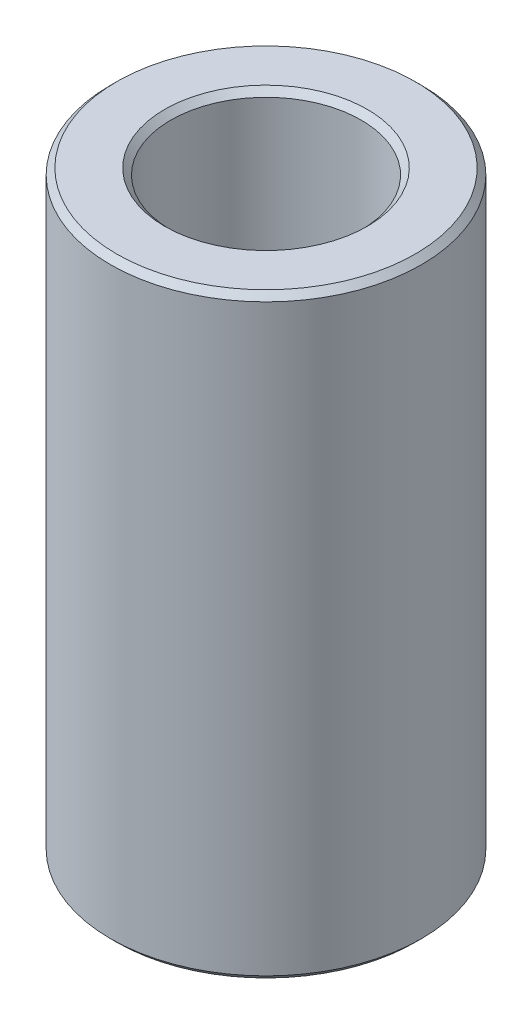
ISO-10303-21;
HEADER;
FILE_DESCRIPTION(('STEP AP214'),'2;1');
FILE_NAME('part.step','',(''),(''),'','','');
FILE_SCHEMA(('AUTOMOTIVE_DESIGN { 1 0 10303 214 1 1 1 1 }'));
ENDSEC;
DATA;
#1=APPLICATION_CONTEXT('core data for automotive mechanical design processes');
#2=APPLICATION_PROTOCOL_DEFINITION('international standard','automotive_design',2000,#1);
#3=PRODUCT_CONTEXT('',#1,'mechanical');
#4=PRODUCT('Part','Part','',(#3));
#5=PRODUCT_RELATED_PRODUCT_CATEGORY('part','',(#4));
#6=PRODUCT_DEFINITION_FORMATION('','',#4);
#7=PRODUCT_DEFINITION_CONTEXT('part definition',#1,'design');
#8=PRODUCT_DEFINITION('design','',#6,#7);
#9=PRODUCT_DEFINITION_SHAPE('','',#8);
#10=(LENGTH_UNIT() NAMED_UNIT(*) SI_UNIT(.MILLI.,.METRE.));
#11=(NAMED_UNIT(*) PLANE_ANGLE_UNIT() SI_UNIT($,.RADIAN.));
#12=(NAMED_UNIT(*) SI_UNIT($,.STERADIAN.) SOLID_ANGLE_UNIT());
#13=UNCERTAINTY_MEASURE_WITH_UNIT(LENGTH_MEASURE(1.E-05),#10,'distance_accuracy_value','');
#14=(GEOMETRIC_REPRESENTATION_CONTEXT(3) GLOBAL_UNCERTAINTY_ASSIGNED_CONTEXT((#13)) GLOBAL_UNIT_ASSIGNED_CONTEXT((#10,
#11,#12)) REPRESENTATION_CONTEXT('',''));
#15=CARTESIAN_POINT('',(0.,0.,0.));
#16=DIRECTION('',(0.,0.,1.));
#17=DIRECTION('',(1.,0.,0.));
#18=AXIS2_PLACEMENT_3D('',#15,#16,#17);
#19=CARTESIAN_POINT('',(0.,162.932795171473,0.));
#20=DIRECTION('',(0.,-1.,0.));
#21=DIRECTION('',(0.,0.,-1.));
#22=AXIS2_PLACEMENT_3D('',#19,#20,#21);
#23=CYLINDRICAL_SURFACE('',#22,42.5);
#24=CARTESIAN_POINT('',(0.,1.68480427426684,0.));
#25=DIRECTION('',(0.,1.,0.));
#26=DIRECTION('',(0.,0.,1.));
#27=AXIS2_PLACEMENT_3D('',#24,#25,#26);
#28=CIRCLE('',#27,42.5);
#29=CARTESIAN_POINT('',(0.,1.68480427426684,42.5));
#30=VERTEX_POINT('',#29);
#31=EDGE_CURVE('E10',#30,#30,#28,.T.);
#32=ORIENTED_EDGE('',*,*,#31,.T.);
#33=EDGE_LOOP('',(#32));
#34=FACE_BOUND('',#33,.T.);
#35=CARTESIAN_POINT('',(0.,161.247990897206,0.));
#36=DIRECTION('',(0.,1.,0.));
#37=DIRECTION('',(0.,0.,1.));
#38=AXIS2_PLACEMENT_3D('',#35,#36,#37);
#39=CIRCLE('',#38,42.5);
#40=CARTESIAN_POINT('',(0.,161.247990897206,42.5));
#41=VERTEX_POINT('',#40);
#42=EDGE_CURVE('E50',#41,#41,#39,.F.);
#43=ORIENTED_EDGE('',*,*,#42,.T.);
#44=EDGE_LOOP('',(#43));
#45=FACE_BOUND('',#44,.T.);
#46=ADVANCED_FACE('F39',(#34,#45),#23,.T.);
#47=CARTESIAN_POINT('',(0.,162.932795171473,0.));
#48=DIRECTION('',(0.,1.,0.));
#49=DIRECTION('',(0.,0.,1.));
#50=AXIS2_PLACEMENT_3D('',#47,#48,#49);
#51=PLANE('',#50);
#52=CARTESIAN_POINT('',(0.,162.932795171473,0.));
#53=DIRECTION('',(0.,1.,0.));
#54=DIRECTION('',(0.,0.,1.));
#55=AXIS2_PLACEMENT_3D('',#52,#53,#54);
#56=CIRCLE('',#55,27.7002730000973);
#57=CARTESIAN_POINT('',(0.,162.932795171473,27.7002730000973));
#58=VERTEX_POINT('',#57);
#59=EDGE_CURVE('E58',#58,#58,#56,.F.);
#60=ORIENTED_EDGE('',*,*,#59,.T.);
#61=EDGE_LOOP('',(#60));
#62=FACE_BOUND('',#61,.T.);
#63=CARTESIAN_POINT('',(0.,162.932795171473,0.));
#64=DIRECTION('',(0.,1.,0.));
#65=DIRECTION('',(0.,0.,1.));
#66=AXIS2_PLACEMENT_3D('',#63,#64,#65);
#67=CIRCLE('',#66,40.8151957257331);
#68=CARTESIAN_POINT('',(0.,162.932795171473,40.8151957257331));
#69=VERTEX_POINT('',#68);
#70=EDGE_CURVE('E61',#69,#69,#67,.T.);
#71=ORIENTED_EDGE('',*,*,#70,.T.);
#72=EDGE_LOOP('',(#71));
#73=FACE_BOUND('',#72,.T.);
#74=ADVANCED_FACE('F88',(#62,#73),#51,.T.);
#75=CARTESIAN_POINT('',(0.,0.,0.));
#76=DIRECTION('',(0.,1.,0.));
#77=DIRECTION('',(0.,0.,1.));
#78=AXIS2_PLACEMENT_3D('',#75,#76,#77);
#79=PLANE('',#78);
#80=CARTESIAN_POINT('',(0.,0.,0.));
#81=DIRECTION('',(0.,1.,0.));
#82=DIRECTION('',(0.,0.,1.));
#83=AXIS2_PLACEMENT_3D('',#80,#81,#82);
#84=CIRCLE('',#83,27.7002730000974);
#85=CARTESIAN_POINT('',(0.,0.,27.7002730000974));
#86=VERTEX_POINT('',#85);
#87=EDGE_CURVE('E51',#86,#86,#84,.T.);
#88=ORIENTED_EDGE('',*,*,#87,.T.);
#89=EDGE_LOOP('',(#88));
#90=FACE_BOUND('',#89,.T.);
#91=CARTESIAN_POINT('',(0.,0.,0.));
#92=DIRECTION('',(0.,1.,0.));
#93=DIRECTION('',(0.,0.,1.));
#94=AXIS2_PLACEMENT_3D('',#91,#92,#93);
#95=CIRCLE('',#94,40.8151957257332);
#96=CARTESIAN_POINT('',(0.,0.,40.8151957257332));
#97=VERTEX_POINT('',#96);
#98=EDGE_CURVE('E54',#97,#97,#95,.F.);
#99=ORIENTED_EDGE('',*,*,#98,.T.);
#100=EDGE_LOOP('',(#99));
#101=FACE_BOUND('',#100,.T.);
#102=ADVANCED_FACE('F83',(#90,#101),#79,.F.);
#103=CARTESIAN_POINT('',(0.,162.932795171473,0.));
#104=DIRECTION('',(0.,-1.,0.));
#105=DIRECTION('',(0.,0.,-1.));
#106=AXIS2_PLACEMENT_3D('',#103,#104,#105);
#107=CYLINDRICAL_SURFACE('',#106,26.0154687258305);
#108=CARTESIAN_POINT('',(0.,161.247990897206,0.));
#109=DIRECTION('',(0.,1.,0.));
#110=DIRECTION('',(0.,0.,1.));
#111=AXIS2_PLACEMENT_3D('',#108,#109,#110);
#112=CIRCLE('',#111,26.0154687258305);
#113=CARTESIAN_POINT('',(0.,161.247990897206,26.0154687258305));
#114=VERTEX_POINT('',#113);
#115=EDGE_CURVE('E67',#114,#114,#112,.T.);
#116=ORIENTED_EDGE('',*,*,#115,.T.);
#117=EDGE_LOOP('',(#116));
#118=FACE_BOUND('',#117,.T.);
#119=CARTESIAN_POINT('',(0.,1.6848042742669,0.));
#120=DIRECTION('',(0.,1.,0.));
#121=DIRECTION('',(0.,0.,1.));
#122=AXIS2_PLACEMENT_3D('',#119,#120,#121);
#123=CIRCLE('',#122,26.0154687258305);
#124=CARTESIAN_POINT('',(0.,1.6848042742669,26.0154687258305));
#125=VERTEX_POINT('',#124);
#126=EDGE_CURVE('E69',#125,#125,#123,.F.);
#127=ORIENTED_EDGE('',*,*,#126,.T.);
#128=EDGE_LOOP('',(#127));
#129=FACE_BOUND('',#128,.T.);
#130=ADVANCED_FACE('F71',(#118,#129),#107,.F.);
#131=CARTESIAN_POINT('',(0.,161.247990897206,0.));
#132=DIRECTION('',(0.,1.,0.));
#133=DIRECTION('',(0.,0.,1.));
#134=AXIS2_PLACEMENT_3D('',#131,#132,#133);
#135=CONICAL_SURFACE('',#134,26.0154687258305,0.785398163397451);
#136=ORIENTED_EDGE('',*,*,#59,.F.);
#137=EDGE_LOOP('',(#136));
#138=FACE_BOUND('',#137,.T.);
#139=ORIENTED_EDGE('',*,*,#115,.F.);
#140=EDGE_LOOP('',(#139));
#141=FACE_BOUND('',#140,.T.);
#142=ADVANCED_FACE('F77',(#138,#141),#135,.F.);
#143=CARTESIAN_POINT('',(0.,0.,0.));
#144=DIRECTION('',(0.,-1.,0.));
#145=DIRECTION('',(0.,0.,-1.));
#146=AXIS2_PLACEMENT_3D('',#143,#144,#145);
#147=CONICAL_SURFACE('',#146,27.7002730000974,0.785398163397436);
#148=ORIENTED_EDGE('',*,*,#126,.F.);
#149=EDGE_LOOP('',(#148));
#150=FACE_BOUND('',#149,.T.);
#151=ORIENTED_EDGE('',*,*,#87,.F.);
#152=EDGE_LOOP('',(#151));
#153=FACE_BOUND('',#152,.T.);
#154=ADVANCED_FACE('F73',(#150,#153),#147,.F.);
#155=CARTESIAN_POINT('',(0.,1.68480427426684,0.));
#156=DIRECTION('',(0.,1.,0.));
#157=DIRECTION('',(0.,0.,1.));
#158=AXIS2_PLACEMENT_3D('',#155,#156,#157);
#159=CONICAL_SURFACE('',#158,42.5,0.785398163397448);
#160=ORIENTED_EDGE('',*,*,#98,.F.);
#161=EDGE_LOOP('',(#160));
#162=FACE_BOUND('',#161,.T.);
#163=ORIENTED_EDGE('',*,*,#31,.F.);
#164=EDGE_LOOP('',(#163));
#165=FACE_BOUND('',#164,.T.);
#166=ADVANCED_FACE('F76',(#162,#165),#159,.T.);
#167=CARTESIAN_POINT('',(0.,162.932795171473,0.));
#168=DIRECTION('',(0.,-1.,0.));
#169=DIRECTION('',(0.,0.,-1.));
#170=AXIS2_PLACEMENT_3D('',#167,#168,#169);
#171=CONICAL_SURFACE('',#170,40.8151957257331,0.78539816339744);
#172=ORIENTED_EDGE('',*,*,#42,.F.);
#173=EDGE_LOOP('',(#172));
#174=FACE_BOUND('',#173,.T.);
#175=ORIENTED_EDGE('',*,*,#70,.F.);
#176=EDGE_LOOP('',(#175));
#177=FACE_BOUND('',#176,.T.);
#178=ADVANCED_FACE('F45',(#174,#177),#171,.T.);
#179=CLOSED_SHELL('',(#46,#74,#102,#130,#142,#154,#166,#178));
#180=MANIFOLD_SOLID_BREP('B2',#179);
#181=ADVANCED_BREP_SHAPE_REPRESENTATION('',(#18,#180),#14);
#182=SHAPE_DEFINITION_REPRESENTATION(#9,#181);
ENDSEC;
END-ISO-10303-21;
